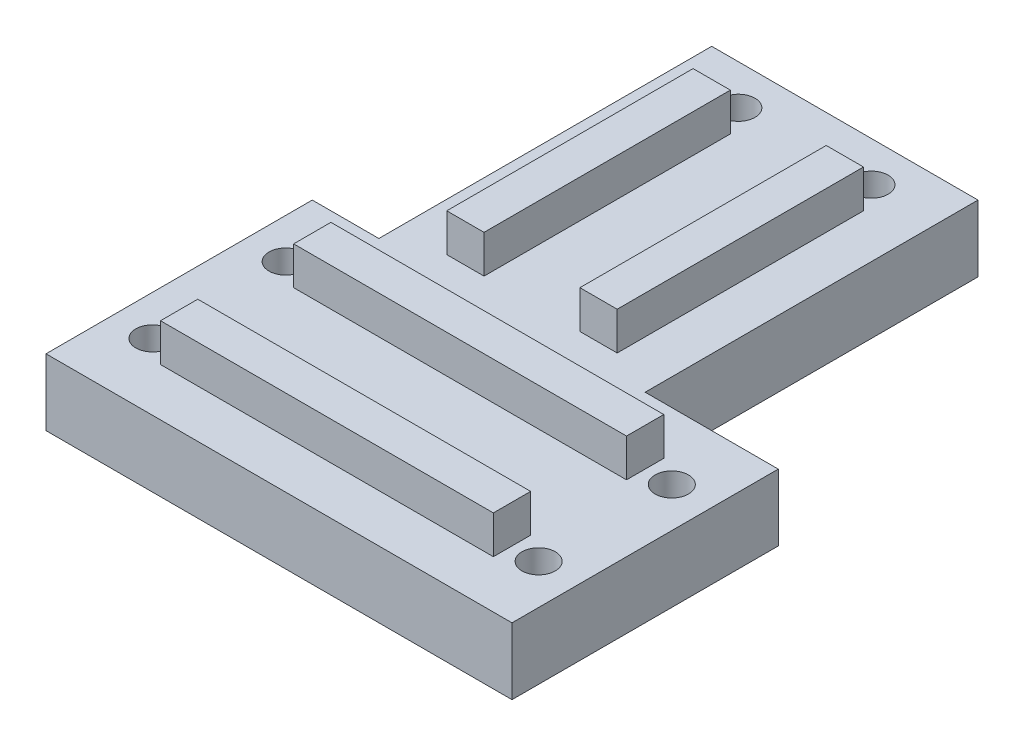
ISO-10303-21;
HEADER;
FILE_DESCRIPTION(('STEP AP214'),'2;1');
FILE_NAME('part.step','',(''),(''),'','','');
FILE_SCHEMA(('AUTOMOTIVE_DESIGN { 1 0 10303 214 1 1 1 1 }'));
ENDSEC;
DATA;
#1=APPLICATION_CONTEXT('core data for automotive mechanical design processes');
#2=APPLICATION_PROTOCOL_DEFINITION('international standard','automotive_design',2000,#1);
#3=PRODUCT_CONTEXT('',#1,'mechanical');
#4=PRODUCT('Part','Part','',(#3));
#5=PRODUCT_RELATED_PRODUCT_CATEGORY('part','',(#4));
#6=PRODUCT_DEFINITION_FORMATION('','',#4);
#7=PRODUCT_DEFINITION_CONTEXT('part definition',#1,'design');
#8=PRODUCT_DEFINITION('design','',#6,#7);
#9=PRODUCT_DEFINITION_SHAPE('','',#8);
#10=(LENGTH_UNIT() NAMED_UNIT(*) SI_UNIT(.MILLI.,.METRE.));
#11=(NAMED_UNIT(*) PLANE_ANGLE_UNIT() SI_UNIT($,.RADIAN.));
#12=(NAMED_UNIT(*) SI_UNIT($,.STERADIAN.) SOLID_ANGLE_UNIT());
#13=UNCERTAINTY_MEASURE_WITH_UNIT(LENGTH_MEASURE(1.E-05),#10,'distance_accuracy_value','');
#14=(GEOMETRIC_REPRESENTATION_CONTEXT(3) GLOBAL_UNCERTAINTY_ASSIGNED_CONTEXT((#13)) GLOBAL_UNIT_ASSIGNED_CONTEXT((#10,
#11,#12)) REPRESENTATION_CONTEXT('',''));
#15=CARTESIAN_POINT('',(0.,0.,0.));
#16=DIRECTION('',(0.,0.,1.));
#17=DIRECTION('',(1.,0.,0.));
#18=AXIS2_PLACEMENT_3D('',#15,#16,#17);
#19=CARTESIAN_POINT('',(70.,15.6999999999998,7.19999999999974));
#20=DIRECTION('',(0.,0.,-1.));
#21=DIRECTION('',(-1.,0.,0.));
#22=AXIS2_PLACEMENT_3D('',#19,#20,#21);
#23=PLANE('',#22);
#24=DIRECTION('',(-1.,0.,0.));
#25=VECTOR('',#24,1.);
#26=CARTESIAN_POINT('',(70.,15.6999999999998,7.19999999999974));
#27=LINE('',#26,#25);
#28=CARTESIAN_POINT('',(30.,15.6999999999998,7.19999999999975));
#29=VERTEX_POINT('',#28);
#30=CARTESIAN_POINT('',(-20.,15.6999999999998,7.19999999999975));
#31=VERTEX_POINT('',#30);
#32=EDGE_CURVE('E224',#29,#31,#27,.T.);
#33=ORIENTED_EDGE('',*,*,#32,.F.);
#34=DIRECTION('',(0.,-1.,0.));
#35=VECTOR('',#34,1.);
#36=CARTESIAN_POINT('',(30.,15.6999999999998,7.19999999999975));
#37=LINE('',#36,#35);
#38=CARTESIAN_POINT('',(30.,10.,7.19999999999975));
#39=VERTEX_POINT('',#38);
#40=EDGE_CURVE('E302',#29,#39,#37,.T.);
#41=ORIENTED_EDGE('',*,*,#40,.T.);
#42=DIRECTION('',(-1.,0.,0.));
#43=VECTOR('',#42,1.);
#44=CARTESIAN_POINT('',(70.,10.,7.19999999999974));
#45=LINE('',#44,#43);
#46=CARTESIAN_POINT('',(-20.,10.,7.19999999999976));
#47=VERTEX_POINT('',#46);
#48=EDGE_CURVE('E244',#39,#47,#45,.T.);
#49=ORIENTED_EDGE('',*,*,#48,.T.);
#50=DIRECTION('',(0.,1.,0.));
#51=VECTOR('',#50,1.);
#52=CARTESIAN_POINT('',(-20.,15.6999999999998,7.19999999999976));
#53=LINE('',#52,#51);
#54=EDGE_CURVE('E200',#47,#31,#53,.T.);
#55=ORIENTED_EDGE('',*,*,#54,.T.);
#56=EDGE_LOOP('',(#33,#41,#49,#55));
#57=FACE_BOUND('',#56,.T.);
#58=ADVANCED_FACE('F34',(#57),#23,.T.);
#59=CARTESIAN_POINT('',(70.,15.6999999999998,12.7999999999997));
#60=DIRECTION('',(0.,1.,0.));
#61=DIRECTION('',(0.,0.,1.));
#62=AXIS2_PLACEMENT_3D('',#59,#60,#61);
#63=PLANE('',#62);
#64=DIRECTION('',(-1.,0.,0.));
#65=VECTOR('',#64,1.);
#66=CARTESIAN_POINT('',(70.,15.6999999999998,12.7999999999997));
#67=LINE('',#66,#65);
#68=CARTESIAN_POINT('',(30.,15.6999999999998,12.7999999999997));
#69=VERTEX_POINT('',#68);
#70=CARTESIAN_POINT('',(-20.,15.6999999999998,12.7999999999998));
#71=VERTEX_POINT('',#70);
#72=EDGE_CURVE('E215',#69,#71,#67,.T.);
#73=ORIENTED_EDGE('',*,*,#72,.F.);
#74=DIRECTION('',(0.,0.,1.));
#75=VECTOR('',#74,1.);
#76=CARTESIAN_POINT('',(30.,15.6999999999998,20.));
#77=LINE('',#76,#75);
#78=EDGE_CURVE('E299',#29,#69,#77,.T.);
#79=ORIENTED_EDGE('',*,*,#78,.F.);
#80=ORIENTED_EDGE('',*,*,#32,.T.);
#81=DIRECTION('',(0.,0.,-1.));
#82=VECTOR('',#81,1.);
#83=CARTESIAN_POINT('',(-20.,15.6999999999998,20.));
#84=LINE('',#83,#82);
#85=EDGE_CURVE('E298',#71,#31,#84,.T.);
#86=ORIENTED_EDGE('',*,*,#85,.F.);
#87=EDGE_LOOP('',(#73,#79,#80,#86));
#88=FACE_BOUND('',#87,.T.);
#89=ADVANCED_FACE('F297',(#88),#63,.T.);
#90=CARTESIAN_POINT('',(70.,10.,12.7999999999997));
#91=DIRECTION('',(0.,0.,1.));
#92=DIRECTION('',(1.,0.,0.));
#93=AXIS2_PLACEMENT_3D('',#90,#91,#92);
#94=PLANE('',#93);
#95=DIRECTION('',(-1.,0.,0.));
#96=VECTOR('',#95,1.);
#97=CARTESIAN_POINT('',(70.,10.,12.7999999999997));
#98=LINE('',#97,#96);
#99=CARTESIAN_POINT('',(30.,10.,12.7999999999997));
#100=VERTEX_POINT('',#99);
#101=CARTESIAN_POINT('',(-20.,10.,12.7999999999998));
#102=VERTEX_POINT('',#101);
#103=EDGE_CURVE('E213',#100,#102,#98,.T.);
#104=ORIENTED_EDGE('',*,*,#103,.F.);
#105=DIRECTION('',(0.,1.,0.));
#106=VECTOR('',#105,1.);
#107=CARTESIAN_POINT('',(30.,10.,12.7999999999998));
#108=LINE('',#107,#106);
#109=EDGE_CURVE('E306',#100,#69,#108,.T.);
#110=ORIENTED_EDGE('',*,*,#109,.T.);
#111=ORIENTED_EDGE('',*,*,#72,.T.);
#112=DIRECTION('',(0.,-1.,0.));
#113=VECTOR('',#112,1.);
#114=CARTESIAN_POINT('',(-20.,10.,12.7999999999998));
#115=LINE('',#114,#113);
#116=EDGE_CURVE('E197',#71,#102,#115,.T.);
#117=ORIENTED_EDGE('',*,*,#116,.T.);
#118=EDGE_LOOP('',(#104,#110,#111,#117));
#119=FACE_BOUND('',#118,.T.);
#120=ADVANCED_FACE('F211',(#119),#94,.T.);
#121=CARTESIAN_POINT('',(70.,15.6999999999996,-12.8000000000003));
#122=DIRECTION('',(0.,0.,-1.));
#123=DIRECTION('',(-1.,0.,0.));
#124=AXIS2_PLACEMENT_3D('',#121,#122,#123);
#125=PLANE('',#124);
#126=DIRECTION('',(-1.,0.,0.));
#127=VECTOR('',#126,1.);
#128=CARTESIAN_POINT('',(70.,15.6999999999996,-12.8000000000003));
#129=LINE('',#128,#127);
#130=CARTESIAN_POINT('',(30.,15.6999999999998,-12.8000000000003));
#131=VERTEX_POINT('',#130);
#132=CARTESIAN_POINT('',(-20.,15.6999999999998,-12.8000000000003));
#133=VERTEX_POINT('',#132);
#134=EDGE_CURVE('E227',#131,#133,#129,.T.);
#135=ORIENTED_EDGE('',*,*,#134,.F.);
#136=DIRECTION('',(0.,-1.,0.));
#137=VECTOR('',#136,1.);
#138=CARTESIAN_POINT('',(30.,15.6999999999996,-12.8000000000003));
#139=LINE('',#138,#137);
#140=CARTESIAN_POINT('',(30.,10.,-12.8000000000003));
#141=VERTEX_POINT('',#140);
#142=EDGE_CURVE('E303',#131,#141,#139,.T.);
#143=ORIENTED_EDGE('',*,*,#142,.T.);
#144=DIRECTION('',(-1.,0.,0.));
#145=VECTOR('',#144,1.);
#146=CARTESIAN_POINT('',(70.,9.99999999999986,-12.8000000000003));
#147=LINE('',#146,#145);
#148=CARTESIAN_POINT('',(-20.,10.,-12.8000000000002));
#149=VERTEX_POINT('',#148);
#150=EDGE_CURVE('E222',#141,#149,#147,.T.);
#151=ORIENTED_EDGE('',*,*,#150,.T.);
#152=DIRECTION('',(0.,1.,0.));
#153=VECTOR('',#152,1.);
#154=CARTESIAN_POINT('',(-20.,15.6999999999996,-12.8000000000002));
#155=LINE('',#154,#153);
#156=EDGE_CURVE('E216',#149,#133,#155,.T.);
#157=ORIENTED_EDGE('',*,*,#156,.T.);
#158=EDGE_LOOP('',(#135,#143,#151,#157));
#159=FACE_BOUND('',#158,.T.);
#160=ADVANCED_FACE('F411',(#159),#125,.T.);
#161=CARTESIAN_POINT('',(70.,15.6999999999996,-7.20000000000026));
#162=DIRECTION('',(0.,1.,0.));
#163=DIRECTION('',(0.,0.,1.));
#164=AXIS2_PLACEMENT_3D('',#161,#162,#163);
#165=PLANE('',#164);
#166=DIRECTION('',(-1.,0.,0.));
#167=VECTOR('',#166,1.);
#168=CARTESIAN_POINT('',(70.,15.6999999999996,-7.20000000000026));
#169=LINE('',#168,#167);
#170=CARTESIAN_POINT('',(30.,15.6999999999998,-7.20000000000025));
#171=VERTEX_POINT('',#170);
#172=CARTESIAN_POINT('',(-20.,15.6999999999998,-7.20000000000024));
#173=VERTEX_POINT('',#172);
#174=EDGE_CURVE('E277',#171,#173,#169,.T.);
#175=ORIENTED_EDGE('',*,*,#174,.F.);
#176=EDGE_CURVE('E259',#131,#171,#77,.T.);
#177=ORIENTED_EDGE('',*,*,#176,.F.);
#178=ORIENTED_EDGE('',*,*,#134,.T.);
#179=EDGE_CURVE('E205',#173,#133,#84,.T.);
#180=ORIENTED_EDGE('',*,*,#179,.F.);
#181=EDGE_LOOP('',(#175,#177,#178,#180));
#182=FACE_BOUND('',#181,.T.);
#183=ADVANCED_FACE('F408',(#182),#165,.T.);
#184=CARTESIAN_POINT('',(70.,9.99999999999986,-7.20000000000026));
#185=DIRECTION('',(0.,0.,1.));
#186=DIRECTION('',(1.,0.,0.));
#187=AXIS2_PLACEMENT_3D('',#184,#185,#186);
#188=PLANE('',#187);
#189=DIRECTION('',(-1.,0.,0.));
#190=VECTOR('',#189,1.);
#191=CARTESIAN_POINT('',(70.,9.99999999999986,-7.20000000000026));
#192=LINE('',#191,#190);
#193=CARTESIAN_POINT('',(30.,10.,-7.20000000000025));
#194=VERTEX_POINT('',#193);
#195=CARTESIAN_POINT('',(-20.,10.,-7.20000000000024));
#196=VERTEX_POINT('',#195);
#197=EDGE_CURVE('E275',#194,#196,#192,.T.);
#198=ORIENTED_EDGE('',*,*,#197,.F.);
#199=DIRECTION('',(0.,1.,0.));
#200=VECTOR('',#199,1.);
#201=CARTESIAN_POINT('',(30.,9.99999999999986,-7.20000000000025));
#202=LINE('',#201,#200);
#203=EDGE_CURVE('E11',#194,#171,#202,.T.);
#204=ORIENTED_EDGE('',*,*,#203,.T.);
#205=ORIENTED_EDGE('',*,*,#174,.T.);
#206=DIRECTION('',(0.,-1.,0.));
#207=VECTOR('',#206,1.);
#208=CARTESIAN_POINT('',(-20.,9.99999999999986,-7.20000000000024));
#209=LINE('',#208,#207);
#210=EDGE_CURVE('E42',#173,#196,#209,.T.);
#211=ORIENTED_EDGE('',*,*,#210,.T.);
#212=EDGE_LOOP('',(#198,#204,#205,#211));
#213=FACE_BOUND('',#212,.T.);
#214=ADVANCED_FACE('F274',(#213),#188,.T.);
#215=CARTESIAN_POINT('',(-20.,0.,-70.));
#216=DIRECTION('',(0.,0.,-1.));
#217=DIRECTION('',(-1.,0.,0.));
#218=AXIS2_PLACEMENT_3D('',#215,#216,#217);
#219=PLANE('',#218);
#220=DIRECTION('',(0.,1.,0.));
#221=VECTOR('',#220,1.);
#222=CARTESIAN_POINT('',(-20.,0.,-70.));
#223=LINE('',#222,#221);
#224=CARTESIAN_POINT('',(-20.,0.,-70.));
#225=VERTEX_POINT('',#224);
#226=CARTESIAN_POINT('',(-20.,10.,-70.));
#227=VERTEX_POINT('',#226);
#228=EDGE_CURVE('E285',#225,#227,#223,.T.);
#229=ORIENTED_EDGE('',*,*,#228,.T.);
#230=DIRECTION('',(-1.,0.,0.));
#231=VECTOR('',#230,1.);
#232=CARTESIAN_POINT('',(-20.,10.,-70.));
#233=LINE('',#232,#231);
#234=CARTESIAN_POINT('',(20.,10.,-70.));
#235=VERTEX_POINT('',#234);
#236=EDGE_CURVE('E387',#235,#227,#233,.T.);
#237=ORIENTED_EDGE('',*,*,#236,.F.);
#238=DIRECTION('',(0.,1.,0.));
#239=VECTOR('',#238,1.);
#240=CARTESIAN_POINT('',(20.,0.,-70.));
#241=LINE('',#240,#239);
#242=CARTESIAN_POINT('',(20.,0.,-70.));
#243=VERTEX_POINT('',#242);
#244=EDGE_CURVE('E289',#243,#235,#241,.T.);
#245=ORIENTED_EDGE('',*,*,#244,.F.);
#246=DIRECTION('',(-1.,0.,0.));
#247=VECTOR('',#246,1.);
#248=CARTESIAN_POINT('',(-20.,0.,-70.));
#249=LINE('',#248,#247);
#250=EDGE_CURVE('E390',#243,#225,#249,.T.);
#251=ORIENTED_EDGE('',*,*,#250,.T.);
#252=EDGE_LOOP('',(#229,#237,#245,#251));
#253=FACE_BOUND('',#252,.T.);
#254=ADVANCED_FACE('F515',(#253),#219,.T.);
#255=CARTESIAN_POINT('',(12.8000000000001,10.,-23.));
#256=DIRECTION('',(1.,0.,0.));
#257=DIRECTION('',(0.,0.,-1.));
#258=AXIS2_PLACEMENT_3D('',#255,#256,#257);
#259=PLANE('',#258);
#260=DIRECTION('',(0.,0.,-1.));
#261=VECTOR('',#260,1.);
#262=CARTESIAN_POINT('',(12.8000000000001,10.,-23.));
#263=LINE('',#262,#261);
#264=CARTESIAN_POINT('',(12.8000000000001,10.,-23.));
#265=VERTEX_POINT('',#264);
#266=CARTESIAN_POINT('',(12.8000000000001,10.,-60.));
#267=VERTEX_POINT('',#266);
#268=EDGE_CURVE('E372',#265,#267,#263,.T.);
#269=ORIENTED_EDGE('',*,*,#268,.T.);
#270=DIRECTION('',(0.,1.,0.));
#271=VECTOR('',#270,1.);
#272=CARTESIAN_POINT('',(12.8000000000001,10.,-60.));
#273=LINE('',#272,#271);
#274=CARTESIAN_POINT('',(12.8000000000001,15.6999999999998,-60.));
#275=VERTEX_POINT('',#274);
#276=EDGE_CURVE('E412',#267,#275,#273,.T.);
#277=ORIENTED_EDGE('',*,*,#276,.T.);
#278=DIRECTION('',(0.,0.,-1.));
#279=VECTOR('',#278,1.);
#280=CARTESIAN_POINT('',(12.8000000000001,15.6999999999996,-23.));
#281=LINE('',#280,#279);
#282=CARTESIAN_POINT('',(12.8000000000001,15.6999999999996,-23.));
#283=VERTEX_POINT('',#282);
#284=EDGE_CURVE('E376',#283,#275,#281,.T.);
#285=ORIENTED_EDGE('',*,*,#284,.F.);
#286=DIRECTION('',(0.,-1.,0.));
#287=VECTOR('',#286,1.);
#288=CARTESIAN_POINT('',(12.8000000000001,10.,-23.));
#289=LINE('',#288,#287);
#290=EDGE_CURVE('E368',#283,#265,#289,.T.);
#291=ORIENTED_EDGE('',*,*,#290,.T.);
#292=EDGE_LOOP('',(#269,#277,#285,#291));
#293=FACE_BOUND('',#292,.T.);
#294=ADVANCED_FACE('F517',(#293),#259,.T.);
#295=CARTESIAN_POINT('',(12.8000000000001,15.6999999999996,-23.));
#296=DIRECTION('',(0.,1.,0.));
#297=DIRECTION('',(0.,0.,1.));
#298=AXIS2_PLACEMENT_3D('',#295,#296,#297);
#299=PLANE('',#298);
#300=ORIENTED_EDGE('',*,*,#284,.T.);
#301=DIRECTION('',(1.,0.,0.));
#302=VECTOR('',#301,1.);
#303=CARTESIAN_POINT('',(-20.,15.6999999999998,-60.));
#304=LINE('',#303,#302);
#305=CARTESIAN_POINT('',(7.20000000000007,15.6999999999998,-60.));
#306=VERTEX_POINT('',#305);
#307=EDGE_CURVE('E432',#306,#275,#304,.T.);
#308=ORIENTED_EDGE('',*,*,#307,.F.);
#309=DIRECTION('',(0.,0.,-1.));
#310=VECTOR('',#309,1.);
#311=CARTESIAN_POINT('',(7.20000000000007,15.6999999999996,-23.));
#312=LINE('',#311,#310);
#313=CARTESIAN_POINT('',(7.20000000000007,15.6999999999996,-23.));
#314=VERTEX_POINT('',#313);
#315=EDGE_CURVE('E379',#314,#306,#312,.T.);
#316=ORIENTED_EDGE('',*,*,#315,.F.);
#317=DIRECTION('',(1.,0.,0.));
#318=VECTOR('',#317,1.);
#319=CARTESIAN_POINT('',(12.8000000000001,15.6999999999996,-23.));
#320=LINE('',#319,#318);
#321=EDGE_CURVE('E365',#314,#283,#320,.T.);
#322=ORIENTED_EDGE('',*,*,#321,.T.);
#323=EDGE_LOOP('',(#300,#308,#316,#322));
#324=FACE_BOUND('',#323,.T.);
#325=ADVANCED_FACE('F523',(#324),#299,.T.);
#326=CARTESIAN_POINT('',(7.20000000000007,15.6999999999996,-23.));
#327=DIRECTION('',(-1.,0.,0.));
#328=DIRECTION('',(0.,-1.,0.));
#329=AXIS2_PLACEMENT_3D('',#326,#327,#328);
#330=PLANE('',#329);
#331=ORIENTED_EDGE('',*,*,#315,.T.);
#332=DIRECTION('',(0.,-1.,0.));
#333=VECTOR('',#332,1.);
#334=CARTESIAN_POINT('',(7.20000000000007,15.6999999999996,-60.));
#335=LINE('',#334,#333);
#336=CARTESIAN_POINT('',(7.20000000000008,10.,-60.));
#337=VERTEX_POINT('',#336);
#338=EDGE_CURVE('E414',#306,#337,#335,.T.);
#339=ORIENTED_EDGE('',*,*,#338,.T.);
#340=DIRECTION('',(0.,0.,-1.));
#341=VECTOR('',#340,1.);
#342=CARTESIAN_POINT('',(7.20000000000008,9.99999999999986,-23.));
#343=LINE('',#342,#341);
#344=CARTESIAN_POINT('',(7.20000000000007,10.,-23.));
#345=VERTEX_POINT('',#344);
#346=EDGE_CURVE('E371',#345,#337,#343,.T.);
#347=ORIENTED_EDGE('',*,*,#346,.F.);
#348=DIRECTION('',(0.,1.,0.));
#349=VECTOR('',#348,1.);
#350=CARTESIAN_POINT('',(7.20000000000007,15.6999999999996,-23.));
#351=LINE('',#350,#349);
#352=EDGE_CURVE('E362',#345,#314,#351,.T.);
#353=ORIENTED_EDGE('',*,*,#352,.T.);
#354=EDGE_LOOP('',(#331,#339,#347,#353));
#355=FACE_BOUND('',#354,.T.);
#356=ADVANCED_FACE('F528',(#355),#330,.T.);
#357=CARTESIAN_POINT('',(-7.19999999999993,10.,-23.));
#358=DIRECTION('',(1.,0.,0.));
#359=DIRECTION('',(0.,0.,-1.));
#360=AXIS2_PLACEMENT_3D('',#357,#358,#359);
#361=PLANE('',#360);
#362=DIRECTION('',(0.,0.,-1.));
#363=VECTOR('',#362,1.);
#364=CARTESIAN_POINT('',(-7.19999999999993,10.,-23.));
#365=LINE('',#364,#363);
#366=CARTESIAN_POINT('',(-7.19999999999993,10.,-23.));
#367=VERTEX_POINT('',#366);
#368=CARTESIAN_POINT('',(-7.19999999999993,10.,-60.));
#369=VERTEX_POINT('',#368);
#370=EDGE_CURVE('E54',#367,#369,#365,.T.);
#371=ORIENTED_EDGE('',*,*,#370,.T.);
#372=DIRECTION('',(0.,1.,0.));
#373=VECTOR('',#372,1.);
#374=CARTESIAN_POINT('',(-7.19999999999993,10.,-60.));
#375=LINE('',#374,#373);
#376=CARTESIAN_POINT('',(-7.19999999999993,15.6999999999998,-60.));
#377=VERTEX_POINT('',#376);
#378=EDGE_CURVE('E419',#369,#377,#375,.T.);
#379=ORIENTED_EDGE('',*,*,#378,.T.);
#380=DIRECTION('',(0.,0.,-1.));
#381=VECTOR('',#380,1.);
#382=CARTESIAN_POINT('',(-7.19999999999993,15.6999999999996,-23.));
#383=LINE('',#382,#381);
#384=CARTESIAN_POINT('',(-7.19999999999993,15.6999999999996,-23.));
#385=VERTEX_POINT('',#384);
#386=EDGE_CURVE('E354',#385,#377,#383,.T.);
#387=ORIENTED_EDGE('',*,*,#386,.F.);
#388=DIRECTION('',(0.,-1.,0.));
#389=VECTOR('',#388,1.);
#390=CARTESIAN_POINT('',(-7.19999999999993,10.,-23.));
#391=LINE('',#390,#389);
#392=EDGE_CURVE('E348',#385,#367,#391,.T.);
#393=ORIENTED_EDGE('',*,*,#392,.T.);
#394=EDGE_LOOP('',(#371,#379,#387,#393));
#395=FACE_BOUND('',#394,.T.);
#396=ADVANCED_FACE('F574',(#395),#361,.T.);
#397=CARTESIAN_POINT('',(-7.19999999999993,15.6999999999996,-23.));
#398=DIRECTION('',(0.,1.,0.));
#399=DIRECTION('',(0.,0.,1.));
#400=AXIS2_PLACEMENT_3D('',#397,#398,#399);
#401=PLANE('',#400);
#402=ORIENTED_EDGE('',*,*,#386,.T.);
#403=CARTESIAN_POINT('',(-12.7999999999999,15.6999999999998,-60.));
#404=VERTEX_POINT('',#403);
#405=EDGE_CURVE('E433',#404,#377,#304,.T.);
#406=ORIENTED_EDGE('',*,*,#405,.F.);
#407=DIRECTION('',(0.,0.,-1.));
#408=VECTOR('',#407,1.);
#409=CARTESIAN_POINT('',(-12.7999999999999,15.6999999999996,-23.));
#410=LINE('',#409,#408);
#411=CARTESIAN_POINT('',(-12.7999999999999,15.6999999999996,-23.));
#412=VERTEX_POINT('',#411);
#413=EDGE_CURVE('E357',#412,#404,#410,.T.);
#414=ORIENTED_EDGE('',*,*,#413,.F.);
#415=DIRECTION('',(1.,0.,0.));
#416=VECTOR('',#415,1.);
#417=CARTESIAN_POINT('',(-7.19999999999993,15.6999999999996,-23.));
#418=LINE('',#417,#416);
#419=EDGE_CURVE('E345',#412,#385,#418,.T.);
#420=ORIENTED_EDGE('',*,*,#419,.T.);
#421=EDGE_LOOP('',(#402,#406,#414,#420));
#422=FACE_BOUND('',#421,.T.);
#423=ADVANCED_FACE('F583',(#422),#401,.T.);
#424=CARTESIAN_POINT('',(-12.7999999999999,15.6999999999996,-23.));
#425=DIRECTION('',(-1.,0.,0.));
#426=DIRECTION('',(0.,-1.,0.));
#427=AXIS2_PLACEMENT_3D('',#424,#425,#426);
#428=PLANE('',#427);
#429=ORIENTED_EDGE('',*,*,#413,.T.);
#430=DIRECTION('',(0.,-1.,0.));
#431=VECTOR('',#430,1.);
#432=CARTESIAN_POINT('',(-12.7999999999999,15.6999999999996,-60.));
#433=LINE('',#432,#431);
#434=CARTESIAN_POINT('',(-12.7999999999999,10.,-60.));
#435=VERTEX_POINT('',#434);
#436=EDGE_CURVE('E254',#404,#435,#433,.T.);
#437=ORIENTED_EDGE('',*,*,#436,.T.);
#438=DIRECTION('',(0.,0.,-1.));
#439=VECTOR('',#438,1.);
#440=CARTESIAN_POINT('',(-12.7999999999999,9.99999999999986,-23.));
#441=LINE('',#440,#439);
#442=CARTESIAN_POINT('',(-12.7999999999999,10.,-23.));
#443=VERTEX_POINT('',#442);
#444=EDGE_CURVE('E351',#443,#435,#441,.T.);
#445=ORIENTED_EDGE('',*,*,#444,.F.);
#446=DIRECTION('',(0.,1.,0.));
#447=VECTOR('',#446,1.);
#448=CARTESIAN_POINT('',(-12.7999999999999,15.6999999999996,-23.));
#449=LINE('',#448,#447);
#450=EDGE_CURVE('E342',#443,#412,#449,.T.);
#451=ORIENTED_EDGE('',*,*,#450,.T.);
#452=EDGE_LOOP('',(#429,#437,#445,#451));
#453=FACE_BOUND('',#452,.T.);
#454=ADVANCED_FACE('F593',(#453),#428,.T.);
#455=CARTESIAN_POINT('',(40.,0.,0.));
#456=DIRECTION('',(1.,0.,0.));
#457=DIRECTION('',(0.,0.,-1.));
#458=AXIS2_PLACEMENT_3D('',#455,#456,#457);
#459=PLANE('',#458);
#460=DIRECTION('',(0.,1.,0.));
#461=VECTOR('',#460,1.);
#462=CARTESIAN_POINT('',(40.,10.,-20.));
#463=LINE('',#462,#461);
#464=CARTESIAN_POINT('',(40.,0.,-20.));
#465=VERTEX_POINT('',#464);
#466=CARTESIAN_POINT('',(40.,10.,-20.));
#467=VERTEX_POINT('',#466);
#468=EDGE_CURVE('E330',#465,#467,#463,.T.);
#469=ORIENTED_EDGE('',*,*,#468,.T.);
#470=DIRECTION('',(0.,0.,1.));
#471=VECTOR('',#470,1.);
#472=CARTESIAN_POINT('',(40.,10.,0.));
#473=LINE('',#472,#471);
#474=CARTESIAN_POINT('',(40.,10.,20.));
#475=VERTEX_POINT('',#474);
#476=EDGE_CURVE('E338',#467,#475,#473,.T.);
#477=ORIENTED_EDGE('',*,*,#476,.T.);
#478=DIRECTION('',(0.,-1.,0.));
#479=VECTOR('',#478,1.);
#480=CARTESIAN_POINT('',(40.,10.,20.));
#481=LINE('',#480,#479);
#482=CARTESIAN_POINT('',(40.,0.,20.));
#483=VERTEX_POINT('',#482);
#484=EDGE_CURVE('E336',#475,#483,#481,.T.);
#485=ORIENTED_EDGE('',*,*,#484,.T.);
#486=DIRECTION('',(0.,0.,1.));
#487=VECTOR('',#486,1.);
#488=CARTESIAN_POINT('',(40.,0.,0.));
#489=LINE('',#488,#487);
#490=EDGE_CURVE('E333',#465,#483,#489,.T.);
#491=ORIENTED_EDGE('',*,*,#490,.F.);
#492=EDGE_LOOP('',(#469,#477,#485,#491));
#493=FACE_BOUND('',#492,.T.);
#494=ADVANCED_FACE('F489',(#493),#459,.T.);
#495=CARTESIAN_POINT('',(-10.,15.6999999999998,-64.));
#496=DIRECTION('',(0.,-1.,0.));
#497=DIRECTION('',(0.,0.,-1.));
#498=AXIS2_PLACEMENT_3D('',#495,#496,#497);
#499=CYLINDRICAL_SURFACE('',#498,2.5);
#500=CARTESIAN_POINT('',(-10.,0.,-64.));
#501=DIRECTION('',(0.,-1.,0.));
#502=DIRECTION('',(0.,0.,-1.));
#503=AXIS2_PLACEMENT_3D('',#500,#501,#502);
#504=CIRCLE('',#503,2.5);
#505=CARTESIAN_POINT('',(-10.,0.,-66.5));
#506=VERTEX_POINT('',#505);
#507=EDGE_CURVE('E315',#506,#506,#504,.T.);
#508=ORIENTED_EDGE('',*,*,#507,.T.);
#509=EDGE_LOOP('',(#508));
#510=FACE_BOUND('',#509,.T.);
#511=CARTESIAN_POINT('',(-10.,10.,-64.));
#512=DIRECTION('',(0.,1.,0.));
#513=DIRECTION('',(0.,0.,1.));
#514=AXIS2_PLACEMENT_3D('',#511,#512,#513);
#515=CIRCLE('',#514,2.5);
#516=CARTESIAN_POINT('',(-10.,10.,-61.5));
#517=VERTEX_POINT('',#516);
#518=EDGE_CURVE('E267',#517,#517,#515,.F.);
#519=ORIENTED_EDGE('',*,*,#518,.F.);
#520=EDGE_LOOP('',(#519));
#521=FACE_BOUND('',#520,.T.);
#522=ADVANCED_FACE('F612',(#510,#521),#499,.F.);
#523=CARTESIAN_POINT('',(10.,15.6999999999998,-64.));
#524=DIRECTION('',(0.,-1.,0.));
#525=DIRECTION('',(0.,0.,-1.));
#526=AXIS2_PLACEMENT_3D('',#523,#524,#525);
#527=CYLINDRICAL_SURFACE('',#526,2.5);
#528=CARTESIAN_POINT('',(10.,0.,-64.));
#529=DIRECTION('',(0.,-1.,0.));
#530=DIRECTION('',(0.,0.,-1.));
#531=AXIS2_PLACEMENT_3D('',#528,#529,#530);
#532=CIRCLE('',#531,2.5);
#533=CARTESIAN_POINT('',(10.,0.,-66.5));
#534=VERTEX_POINT('',#533);
#535=EDGE_CURVE('E312',#534,#534,#532,.T.);
#536=ORIENTED_EDGE('',*,*,#535,.T.);
#537=EDGE_LOOP('',(#536));
#538=FACE_BOUND('',#537,.T.);
#539=CARTESIAN_POINT('',(10.,10.,-64.));
#540=DIRECTION('',(0.,1.,0.));
#541=DIRECTION('',(0.,0.,1.));
#542=AXIS2_PLACEMENT_3D('',#539,#540,#541);
#543=CIRCLE('',#542,2.5);
#544=CARTESIAN_POINT('',(10.,10.,-61.5));
#545=VERTEX_POINT('',#544);
#546=EDGE_CURVE('E264',#545,#545,#543,.F.);
#547=ORIENTED_EDGE('',*,*,#546,.F.);
#548=EDGE_LOOP('',(#547));
#549=FACE_BOUND('',#548,.T.);
#550=ADVANCED_FACE('F621',(#538,#549),#527,.F.);
#551=CARTESIAN_POINT('',(34.,15.6999999999998,-10.));
#552=DIRECTION('',(0.,-1.,0.));
#553=DIRECTION('',(0.,0.,-1.));
#554=AXIS2_PLACEMENT_3D('',#551,#552,#553);
#555=CYLINDRICAL_SURFACE('',#554,2.49999999999999);
#556=CARTESIAN_POINT('',(34.,0.,-10.));
#557=DIRECTION('',(0.,-1.,0.));
#558=DIRECTION('',(0.,0.,-1.));
#559=AXIS2_PLACEMENT_3D('',#556,#557,#558);
#560=CIRCLE('',#559,2.49999999999999);
#561=CARTESIAN_POINT('',(34.,0.,-12.5));
#562=VERTEX_POINT('',#561);
#563=EDGE_CURVE('E322',#562,#562,#560,.T.);
#564=ORIENTED_EDGE('',*,*,#563,.T.);
#565=EDGE_LOOP('',(#564));
#566=FACE_BOUND('',#565,.T.);
#567=CARTESIAN_POINT('',(34.,10.,-10.));
#568=DIRECTION('',(0.,1.,0.));
#569=DIRECTION('',(0.,0.,1.));
#570=AXIS2_PLACEMENT_3D('',#567,#568,#569);
#571=CIRCLE('',#570,2.49999999999999);
#572=CARTESIAN_POINT('',(34.,10.,-7.50000000000001));
#573=VERTEX_POINT('',#572);
#574=EDGE_CURVE('E263',#573,#573,#571,.F.);
#575=ORIENTED_EDGE('',*,*,#574,.F.);
#576=EDGE_LOOP('',(#575));
#577=FACE_BOUND('',#576,.T.);
#578=ADVANCED_FACE('F482',(#566,#577),#555,.F.);
#579=CARTESIAN_POINT('',(34.,15.6999999999998,10.));
#580=DIRECTION('',(0.,-1.,0.));
#581=DIRECTION('',(0.,0.,-1.));
#582=AXIS2_PLACEMENT_3D('',#579,#580,#581);
#583=CYLINDRICAL_SURFACE('',#582,2.49999999999999);
#584=CARTESIAN_POINT('',(34.,0.,10.));
#585=DIRECTION('',(0.,-1.,0.));
#586=DIRECTION('',(0.,0.,-1.));
#587=AXIS2_PLACEMENT_3D('',#584,#585,#586);
#588=CIRCLE('',#587,2.49999999999999);
#589=CARTESIAN_POINT('',(34.,0.,7.50000000000001));
#590=VERTEX_POINT('',#589);
#591=EDGE_CURVE('E325',#590,#590,#588,.T.);
#592=ORIENTED_EDGE('',*,*,#591,.T.);
#593=EDGE_LOOP('',(#592));
#594=FACE_BOUND('',#593,.T.);
#595=CARTESIAN_POINT('',(34.,10.,10.));
#596=DIRECTION('',(0.,1.,0.));
#597=DIRECTION('',(0.,0.,1.));
#598=AXIS2_PLACEMENT_3D('',#595,#596,#597);
#599=CIRCLE('',#598,2.49999999999999);
#600=CARTESIAN_POINT('',(34.,10.,12.5));
#601=VERTEX_POINT('',#600);
#602=EDGE_CURVE('E260',#601,#601,#599,.F.);
#603=ORIENTED_EDGE('',*,*,#602,.F.);
#604=EDGE_LOOP('',(#603));
#605=FACE_BOUND('',#604,.T.);
#606=ADVANCED_FACE('F477',(#594,#605),#583,.F.);
#607=CARTESIAN_POINT('',(40.,10.,20.));
#608=DIRECTION('',(0.,0.,-1.));
#609=DIRECTION('',(-1.,0.,0.));
#610=AXIS2_PLACEMENT_3D('',#607,#608,#609);
#611=PLANE('',#610);
#612=ORIENTED_EDGE('',*,*,#484,.F.);
#613=DIRECTION('',(1.,0.,0.));
#614=VECTOR('',#613,1.);
#615=CARTESIAN_POINT('',(40.,10.,20.));
#616=LINE('',#615,#614);
#617=CARTESIAN_POINT('',(-30.,10.,20.));
#618=VERTEX_POINT('',#617);
#619=EDGE_CURVE('E233',#618,#475,#616,.T.);
#620=ORIENTED_EDGE('',*,*,#619,.F.);
#621=DIRECTION('',(0.,-1.,0.));
#622=VECTOR('',#621,1.);
#623=CARTESIAN_POINT('',(-30.,10.,20.));
#624=LINE('',#623,#622);
#625=CARTESIAN_POINT('',(-30.,0.,20.));
#626=VERTEX_POINT('',#625);
#627=EDGE_CURVE('E251',#618,#626,#624,.T.);
#628=ORIENTED_EDGE('',*,*,#627,.T.);
#629=DIRECTION('',(1.,0.,0.));
#630=VECTOR('',#629,1.);
#631=CARTESIAN_POINT('',(40.,0.,20.));
#632=LINE('',#631,#630);
#633=EDGE_CURVE('E243',#626,#483,#632,.T.);
#634=ORIENTED_EDGE('',*,*,#633,.T.);
#635=EDGE_LOOP('',(#612,#620,#628,#634));
#636=FACE_BOUND('',#635,.T.);
#637=ADVANCED_FACE('F474',(#636),#611,.F.);
#638=CARTESIAN_POINT('',(20.,10.,-20.));
#639=DIRECTION('',(0.,0.,1.));
#640=DIRECTION('',(1.,0.,0.));
#641=AXIS2_PLACEMENT_3D('',#638,#639,#640);
#642=PLANE('',#641);
#643=ORIENTED_EDGE('',*,*,#468,.F.);
#644=DIRECTION('',(-1.,0.,0.));
#645=VECTOR('',#644,1.);
#646=CARTESIAN_POINT('',(20.,0.,-20.));
#647=LINE('',#646,#645);
#648=CARTESIAN_POINT('',(20.,0.,-20.));
#649=VERTEX_POINT('',#648);
#650=EDGE_CURVE('E234',#465,#649,#647,.T.);
#651=ORIENTED_EDGE('',*,*,#650,.T.);
#652=DIRECTION('',(0.,1.,0.));
#653=VECTOR('',#652,1.);
#654=CARTESIAN_POINT('',(20.,0.,-20.));
#655=LINE('',#654,#653);
#656=CARTESIAN_POINT('',(20.,10.,-20.));
#657=VERTEX_POINT('',#656);
#658=EDGE_CURVE('E400',#649,#657,#655,.T.);
#659=ORIENTED_EDGE('',*,*,#658,.T.);
#660=DIRECTION('',(-1.,0.,0.));
#661=VECTOR('',#660,1.);
#662=CARTESIAN_POINT('',(20.,10.,-20.));
#663=LINE('',#662,#661);
#664=EDGE_CURVE('E237',#467,#657,#663,.T.);
#665=ORIENTED_EDGE('',*,*,#664,.F.);
#666=EDGE_LOOP('',(#643,#651,#659,#665));
#667=FACE_BOUND('',#666,.T.);
#668=ADVANCED_FACE('F468',(#667),#642,.F.);
#669=CARTESIAN_POINT('',(0.,10.,0.));
#670=DIRECTION('',(0.,-1.,0.));
#671=DIRECTION('',(0.,0.,-1.));
#672=AXIS2_PLACEMENT_3D('',#669,#670,#671);
#673=PLANE('',#672);
#674=ORIENTED_EDGE('',*,*,#150,.F.);
#675=DIRECTION('',(0.,0.,1.));
#676=VECTOR('',#675,1.);
#677=CARTESIAN_POINT('',(30.,10.,20.));
#678=LINE('',#677,#676);
#679=EDGE_CURVE('E284',#141,#194,#678,.T.);
#680=ORIENTED_EDGE('',*,*,#679,.T.);
#681=ORIENTED_EDGE('',*,*,#197,.T.);
#682=DIRECTION('',(0.,0.,-1.));
#683=VECTOR('',#682,1.);
#684=CARTESIAN_POINT('',(-20.,10.,20.));
#685=LINE('',#684,#683);
#686=EDGE_CURVE('E206',#196,#149,#685,.T.);
#687=ORIENTED_EDGE('',*,*,#686,.T.);
#688=EDGE_LOOP('',(#674,#680,#681,#687));
#689=FACE_BOUND('',#688,.T.);
#690=ORIENTED_EDGE('',*,*,#48,.F.);
#691=EDGE_CURVE('E221',#39,#100,#678,.T.);
#692=ORIENTED_EDGE('',*,*,#691,.T.);
#693=ORIENTED_EDGE('',*,*,#103,.T.);
#694=EDGE_CURVE('E194',#102,#47,#685,.T.);
#695=ORIENTED_EDGE('',*,*,#694,.T.);
#696=EDGE_LOOP('',(#690,#692,#693,#695));
#697=FACE_BOUND('',#696,.T.);
#698=ORIENTED_EDGE('',*,*,#619,.T.);
#699=ORIENTED_EDGE('',*,*,#476,.F.);
#700=ORIENTED_EDGE('',*,*,#664,.T.);
#701=DIRECTION('',(0.,0.,-1.));
#702=VECTOR('',#701,1.);
#703=CARTESIAN_POINT('',(20.,10.,-70.));
#704=LINE('',#703,#702);
#705=EDGE_CURVE('E395',#657,#235,#704,.T.);
#706=ORIENTED_EDGE('',*,*,#705,.T.);
#707=ORIENTED_EDGE('',*,*,#236,.T.);
#708=DIRECTION('',(0.,0.,1.));
#709=VECTOR('',#708,1.);
#710=CARTESIAN_POINT('',(-20.,10.,-70.));
#711=LINE('',#710,#709);
#712=CARTESIAN_POINT('',(-20.,10.,-20.));
#713=VERTEX_POINT('',#712);
#714=EDGE_CURVE('E375',#227,#713,#711,.T.);
#715=ORIENTED_EDGE('',*,*,#714,.T.);
#716=CARTESIAN_POINT('',(-30.,10.,-20.));
#717=VERTEX_POINT('',#716);
#718=EDGE_CURVE('E236',#713,#717,#663,.T.);
#719=ORIENTED_EDGE('',*,*,#718,.T.);
#720=DIRECTION('',(0.,0.,1.));
#721=VECTOR('',#720,1.);
#722=CARTESIAN_POINT('',(-30.,10.,-20.));
#723=LINE('',#722,#721);
#724=EDGE_CURVE('E231',#717,#618,#723,.T.);
#725=ORIENTED_EDGE('',*,*,#724,.T.);
#726=EDGE_LOOP('',(#698,#699,#700,#706,#707,#715,#719,#725));
#727=FACE_BOUND('',#726,.T.);
#728=CARTESIAN_POINT('',(-24.,10.,10.));
#729=DIRECTION('',(0.,-1.,0.));
#730=DIRECTION('',(0.,0.,-1.));
#731=AXIS2_PLACEMENT_3D('',#728,#729,#730);
#732=CIRCLE('',#731,2.5);
#733=CARTESIAN_POINT('',(-24.,10.,7.5));
#734=VERTEX_POINT('',#733);
#735=EDGE_CURVE('E255',#734,#734,#732,.F.);
#736=ORIENTED_EDGE('',*,*,#735,.F.);
#737=EDGE_LOOP('',(#736));
#738=FACE_BOUND('',#737,.T.);
#739=CARTESIAN_POINT('',(-24.,10.,-10.));
#740=DIRECTION('',(0.,-1.,0.));
#741=DIRECTION('',(0.,0.,-1.));
#742=AXIS2_PLACEMENT_3D('',#739,#740,#741);
#743=CIRCLE('',#742,2.5);
#744=CARTESIAN_POINT('',(-24.,10.,-12.5));
#745=VERTEX_POINT('',#744);
#746=EDGE_CURVE('E258',#745,#745,#743,.F.);
#747=ORIENTED_EDGE('',*,*,#746,.F.);
#748=EDGE_LOOP('',(#747));
#749=FACE_BOUND('',#748,.T.);
#750=ORIENTED_EDGE('',*,*,#602,.T.);
#751=EDGE_LOOP('',(#750));
#752=FACE_BOUND('',#751,.T.);
#753=ORIENTED_EDGE('',*,*,#574,.T.);
#754=EDGE_LOOP('',(#753));
#755=FACE_BOUND('',#754,.T.);
#756=ORIENTED_EDGE('',*,*,#444,.T.);
#757=DIRECTION('',(1.,0.,0.));
#758=VECTOR('',#757,1.);
#759=CARTESIAN_POINT('',(-20.,10.,-60.));
#760=LINE('',#759,#758);
#761=EDGE_CURVE('E431',#435,#369,#760,.T.);
#762=ORIENTED_EDGE('',*,*,#761,.T.);
#763=ORIENTED_EDGE('',*,*,#370,.F.);
#764=DIRECTION('',(-1.,0.,0.));
#765=VECTOR('',#764,1.);
#766=CARTESIAN_POINT('',(-12.7999999999999,9.99999999999986,-23.));
#767=LINE('',#766,#765);
#768=EDGE_CURVE('E49',#367,#443,#767,.T.);
#769=ORIENTED_EDGE('',*,*,#768,.T.);
#770=EDGE_LOOP('',(#756,#762,#763,#769));
#771=FACE_BOUND('',#770,.T.);
#772=ORIENTED_EDGE('',*,*,#346,.T.);
#773=EDGE_CURVE('E428',#337,#267,#760,.T.);
#774=ORIENTED_EDGE('',*,*,#773,.T.);
#775=ORIENTED_EDGE('',*,*,#268,.F.);
#776=DIRECTION('',(-1.,0.,0.));
#777=VECTOR('',#776,1.);
#778=CARTESIAN_POINT('',(7.20000000000008,9.99999999999986,-23.));
#779=LINE('',#778,#777);
#780=EDGE_CURVE('E353',#265,#345,#779,.T.);
#781=ORIENTED_EDGE('',*,*,#780,.T.);
#782=EDGE_LOOP('',(#772,#774,#775,#781));
#783=FACE_BOUND('',#782,.T.);
#784=ORIENTED_EDGE('',*,*,#518,.T.);
#785=EDGE_LOOP('',(#784));
#786=FACE_BOUND('',#785,.T.);
#787=ORIENTED_EDGE('',*,*,#546,.T.);
#788=EDGE_LOOP('',(#787));
#789=FACE_BOUND('',#788,.T.);
#790=ADVANCED_FACE('F219',(#689,#697,#727,#738,#749,#752,#755,#771,#783,#786,#789),#673,.F.);
#791=CARTESIAN_POINT('',(0.,0.,0.));
#792=DIRECTION('',(0.,-1.,0.));
#793=DIRECTION('',(0.,0.,-1.));
#794=AXIS2_PLACEMENT_3D('',#791,#792,#793);
#795=PLANE('',#794);
#796=ORIENTED_EDGE('',*,*,#507,.F.);
#797=EDGE_LOOP('',(#796));
#798=FACE_BOUND('',#797,.T.);
#799=CARTESIAN_POINT('',(-24.,0.,-10.));
#800=DIRECTION('',(0.,-1.,0.));
#801=DIRECTION('',(0.,0.,-1.));
#802=AXIS2_PLACEMENT_3D('',#799,#800,#801);
#803=CIRCLE('',#802,2.5);
#804=CARTESIAN_POINT('',(-24.,0.,-12.5));
#805=VERTEX_POINT('',#804);
#806=EDGE_CURVE('E316',#805,#805,#803,.T.);
#807=ORIENTED_EDGE('',*,*,#806,.F.);
#808=EDGE_LOOP('',(#807));
#809=FACE_BOUND('',#808,.T.);
#810=CARTESIAN_POINT('',(-24.,0.,10.));
#811=DIRECTION('',(0.,-1.,0.));
#812=DIRECTION('',(0.,0.,-1.));
#813=AXIS2_PLACEMENT_3D('',#810,#811,#812);
#814=CIRCLE('',#813,2.5);
#815=CARTESIAN_POINT('',(-24.,0.,7.5));
#816=VERTEX_POINT('',#815);
#817=EDGE_CURVE('E319',#816,#816,#814,.T.);
#818=ORIENTED_EDGE('',*,*,#817,.F.);
#819=EDGE_LOOP('',(#818));
#820=FACE_BOUND('',#819,.T.);
#821=ORIENTED_EDGE('',*,*,#563,.F.);
#822=EDGE_LOOP('',(#821));
#823=FACE_BOUND('',#822,.T.);
#824=ORIENTED_EDGE('',*,*,#535,.F.);
#825=EDGE_LOOP('',(#824));
#826=FACE_BOUND('',#825,.T.);
#827=ORIENTED_EDGE('',*,*,#591,.F.);
#828=EDGE_LOOP('',(#827));
#829=FACE_BOUND('',#828,.T.);
#830=ORIENTED_EDGE('',*,*,#650,.F.);
#831=ORIENTED_EDGE('',*,*,#490,.T.);
#832=ORIENTED_EDGE('',*,*,#633,.F.);
#833=DIRECTION('',(0.,0.,1.));
#834=VECTOR('',#833,1.);
#835=CARTESIAN_POINT('',(-30.,0.,-20.));
#836=LINE('',#835,#834);
#837=CARTESIAN_POINT('',(-30.,0.,-20.));
#838=VERTEX_POINT('',#837);
#839=EDGE_CURVE('E240',#838,#626,#836,.T.);
#840=ORIENTED_EDGE('',*,*,#839,.F.);
#841=CARTESIAN_POINT('',(-20.,0.,-20.));
#842=VERTEX_POINT('',#841);
#843=EDGE_CURVE('E247',#842,#838,#647,.T.);
#844=ORIENTED_EDGE('',*,*,#843,.F.);
#845=DIRECTION('',(0.,0.,1.));
#846=VECTOR('',#845,1.);
#847=CARTESIAN_POINT('',(-20.,0.,-70.));
#848=LINE('',#847,#846);
#849=EDGE_CURVE('E384',#225,#842,#848,.T.);
#850=ORIENTED_EDGE('',*,*,#849,.F.);
#851=ORIENTED_EDGE('',*,*,#250,.F.);
#852=DIRECTION('',(0.,0.,-1.));
#853=VECTOR('',#852,1.);
#854=CARTESIAN_POINT('',(20.,0.,-70.));
#855=LINE('',#854,#853);
#856=EDGE_CURVE('E386',#649,#243,#855,.T.);
#857=ORIENTED_EDGE('',*,*,#856,.F.);
#858=EDGE_LOOP('',(#830,#831,#832,#840,#844,#850,#851,#857));
#859=FACE_BOUND('',#858,.T.);
#860=ADVANCED_FACE('F467',(#798,#809,#820,#823,#826,#829,#859),#795,.T.);
#861=DIRECTION('',(0.,1.,0.));
#862=VECTOR('',#861,1.);
#863=CARTESIAN_POINT('',(-20.,0.,-20.));
#864=LINE('',#863,#862);
#865=EDGE_CURVE('E393',#842,#713,#864,.T.);
#866=ORIENTED_EDGE('',*,*,#865,.F.);
#867=ORIENTED_EDGE('',*,*,#843,.T.);
#868=DIRECTION('',(0.,-1.,0.));
#869=VECTOR('',#868,1.);
#870=CARTESIAN_POINT('',(-30.,10.,-20.));
#871=LINE('',#870,#869);
#872=EDGE_CURVE('E239',#717,#838,#871,.T.);
#873=ORIENTED_EDGE('',*,*,#872,.F.);
#874=ORIENTED_EDGE('',*,*,#718,.F.);
#875=EDGE_LOOP('',(#866,#867,#873,#874));
#876=FACE_BOUND('',#875,.T.);
#877=ADVANCED_FACE('F471',(#876),#642,.F.);
#878=CARTESIAN_POINT('',(-30.,10.,-20.));
#879=DIRECTION('',(1.,0.,0.));
#880=DIRECTION('',(0.,0.,-1.));
#881=AXIS2_PLACEMENT_3D('',#878,#879,#880);
#882=PLANE('',#881);
#883=ORIENTED_EDGE('',*,*,#627,.F.);
#884=ORIENTED_EDGE('',*,*,#724,.F.);
#885=ORIENTED_EDGE('',*,*,#872,.T.);
#886=ORIENTED_EDGE('',*,*,#839,.T.);
#887=EDGE_LOOP('',(#883,#884,#885,#886));
#888=FACE_BOUND('',#887,.T.);
#889=ADVANCED_FACE('F36',(#888),#882,.F.);
#890=CARTESIAN_POINT('',(-20.,0.,-70.));
#891=DIRECTION('',(-1.,0.,0.));
#892=DIRECTION('',(0.,0.,1.));
#893=AXIS2_PLACEMENT_3D('',#890,#891,#892);
#894=PLANE('',#893);
#895=ORIENTED_EDGE('',*,*,#714,.F.);
#896=ORIENTED_EDGE('',*,*,#228,.F.);
#897=ORIENTED_EDGE('',*,*,#849,.T.);
#898=ORIENTED_EDGE('',*,*,#865,.T.);
#899=EDGE_LOOP('',(#895,#896,#897,#898));
#900=FACE_BOUND('',#899,.T.);
#901=ADVANCED_FACE('F513',(#900),#894,.T.);
#902=CARTESIAN_POINT('',(20.,0.,-70.));
#903=DIRECTION('',(1.,0.,0.));
#904=DIRECTION('',(0.,0.,-1.));
#905=AXIS2_PLACEMENT_3D('',#902,#903,#904);
#906=PLANE('',#905);
#907=ORIENTED_EDGE('',*,*,#705,.F.);
#908=ORIENTED_EDGE('',*,*,#658,.F.);
#909=ORIENTED_EDGE('',*,*,#856,.T.);
#910=ORIENTED_EDGE('',*,*,#244,.T.);
#911=EDGE_LOOP('',(#907,#908,#909,#910));
#912=FACE_BOUND('',#911,.T.);
#913=ADVANCED_FACE('F500',(#912),#906,.T.);
#914=CARTESIAN_POINT('',(0.,0.,-23.));
#915=DIRECTION('',(0.,0.,1.));
#916=DIRECTION('',(1.,0.,0.));
#917=AXIS2_PLACEMENT_3D('',#914,#915,#916);
#918=PLANE('',#917);
#919=ORIENTED_EDGE('',*,*,#780,.F.);
#920=ORIENTED_EDGE('',*,*,#290,.F.);
#921=ORIENTED_EDGE('',*,*,#321,.F.);
#922=ORIENTED_EDGE('',*,*,#352,.F.);
#923=EDGE_LOOP('',(#919,#920,#921,#922));
#924=FACE_BOUND('',#923,.T.);
#925=ADVANCED_FACE('F532',(#924),#918,.T.);
#926=CARTESIAN_POINT('',(0.,0.,-23.));
#927=DIRECTION('',(0.,0.,1.));
#928=DIRECTION('',(1.,0.,0.));
#929=AXIS2_PLACEMENT_3D('',#926,#927,#928);
#930=PLANE('',#929);
#931=ORIENTED_EDGE('',*,*,#768,.F.);
#932=ORIENTED_EDGE('',*,*,#392,.F.);
#933=ORIENTED_EDGE('',*,*,#419,.F.);
#934=ORIENTED_EDGE('',*,*,#450,.F.);
#935=EDGE_LOOP('',(#931,#932,#933,#934));
#936=FACE_BOUND('',#935,.T.);
#937=ADVANCED_FACE('F703',(#936),#930,.T.);
#938=CARTESIAN_POINT('',(-24.,15.6999999999998,-10.));
#939=DIRECTION('',(0.,-1.,0.));
#940=DIRECTION('',(0.,0.,-1.));
#941=AXIS2_PLACEMENT_3D('',#938,#939,#940);
#942=CYLINDRICAL_SURFACE('',#941,2.5);
#943=ORIENTED_EDGE('',*,*,#746,.T.);
#944=EDGE_LOOP('',(#943));
#945=FACE_BOUND('',#944,.T.);
#946=ORIENTED_EDGE('',*,*,#806,.T.);
#947=EDGE_LOOP('',(#946));
#948=FACE_BOUND('',#947,.T.);
#949=ADVANCED_FACE('F698',(#945,#948),#942,.F.);
#950=CARTESIAN_POINT('',(-24.,15.6999999999998,10.));
#951=DIRECTION('',(0.,-1.,0.));
#952=DIRECTION('',(0.,0.,-1.));
#953=AXIS2_PLACEMENT_3D('',#950,#951,#952);
#954=CYLINDRICAL_SURFACE('',#953,2.5);
#955=ORIENTED_EDGE('',*,*,#735,.T.);
#956=EDGE_LOOP('',(#955));
#957=FACE_BOUND('',#956,.T.);
#958=ORIENTED_EDGE('',*,*,#817,.T.);
#959=EDGE_LOOP('',(#958));
#960=FACE_BOUND('',#959,.T.);
#961=ADVANCED_FACE('F702',(#957,#960),#954,.F.);
#962=CARTESIAN_POINT('',(-20.,15.6999999999998,20.));
#963=DIRECTION('',(-1.,0.,0.));
#964=DIRECTION('',(0.,0.,1.));
#965=AXIS2_PLACEMENT_3D('',#962,#963,#964);
#966=PLANE('',#965);
#967=ORIENTED_EDGE('',*,*,#694,.F.);
#968=ORIENTED_EDGE('',*,*,#116,.F.);
#969=ORIENTED_EDGE('',*,*,#85,.T.);
#970=ORIENTED_EDGE('',*,*,#54,.F.);
#971=EDGE_LOOP('',(#967,#968,#969,#970));
#972=FACE_BOUND('',#971,.T.);
#973=ADVANCED_FACE('F196',(#972),#966,.T.);
#974=CARTESIAN_POINT('',(30.,15.6999999999998,20.));
#975=DIRECTION('',(1.,0.,0.));
#976=DIRECTION('',(0.,0.,-1.));
#977=AXIS2_PLACEMENT_3D('',#974,#975,#976);
#978=PLANE('',#977);
#979=ORIENTED_EDGE('',*,*,#78,.T.);
#980=ORIENTED_EDGE('',*,*,#109,.F.);
#981=ORIENTED_EDGE('',*,*,#691,.F.);
#982=ORIENTED_EDGE('',*,*,#40,.F.);
#983=EDGE_LOOP('',(#979,#980,#981,#982));
#984=FACE_BOUND('',#983,.T.);
#985=ADVANCED_FACE('F444',(#984),#978,.T.);
#986=ORIENTED_EDGE('',*,*,#686,.F.);
#987=ORIENTED_EDGE('',*,*,#210,.F.);
#988=ORIENTED_EDGE('',*,*,#179,.T.);
#989=ORIENTED_EDGE('',*,*,#156,.F.);
#990=EDGE_LOOP('',(#986,#987,#988,#989));
#991=FACE_BOUND('',#990,.T.);
#992=ADVANCED_FACE('F442',(#991),#966,.T.);
#993=ORIENTED_EDGE('',*,*,#176,.T.);
#994=ORIENTED_EDGE('',*,*,#203,.F.);
#995=ORIENTED_EDGE('',*,*,#679,.F.);
#996=ORIENTED_EDGE('',*,*,#142,.F.);
#997=EDGE_LOOP('',(#993,#994,#995,#996));
#998=FACE_BOUND('',#997,.T.);
#999=ADVANCED_FACE('F439',(#998),#978,.T.);
#1000=CARTESIAN_POINT('',(-20.,15.6999999999998,-60.));
#1001=DIRECTION('',(0.,0.,-1.));
#1002=DIRECTION('',(-1.,0.,0.));
#1003=AXIS2_PLACEMENT_3D('',#1000,#1001,#1002);
#1004=PLANE('',#1003);
#1005=ORIENTED_EDGE('',*,*,#773,.F.);
#1006=ORIENTED_EDGE('',*,*,#338,.F.);
#1007=ORIENTED_EDGE('',*,*,#307,.T.);
#1008=ORIENTED_EDGE('',*,*,#276,.F.);
#1009=EDGE_LOOP('',(#1005,#1006,#1007,#1008));
#1010=FACE_BOUND('',#1009,.T.);
#1011=ADVANCED_FACE('F441',(#1010),#1004,.T.);
#1012=ORIENTED_EDGE('',*,*,#761,.F.);
#1013=ORIENTED_EDGE('',*,*,#436,.F.);
#1014=ORIENTED_EDGE('',*,*,#405,.T.);
#1015=ORIENTED_EDGE('',*,*,#378,.F.);
#1016=EDGE_LOOP('',(#1012,#1013,#1014,#1015));
#1017=FACE_BOUND('',#1016,.T.);
#1018=ADVANCED_FACE('F449',(#1017),#1004,.T.);
#1019=CLOSED_SHELL('',(#58,#89,#120,#160,#183,#214,#254,#294,#325,#356,#396,#423,#454,#494,#522,
#550,#578,#606,#637,#668,#790,#860,#877,#889,#901,#913,#925,#937,#949,#961,#973,#985,#992,#999,
#1011,#1018));
#1020=MANIFOLD_SOLID_BREP('B2',#1019);
#1021=ADVANCED_BREP_SHAPE_REPRESENTATION('',(#18,#1020),#14);
#1022=SHAPE_DEFINITION_REPRESENTATION(#9,#1021);
ENDSEC;
END-ISO-10303-21;
